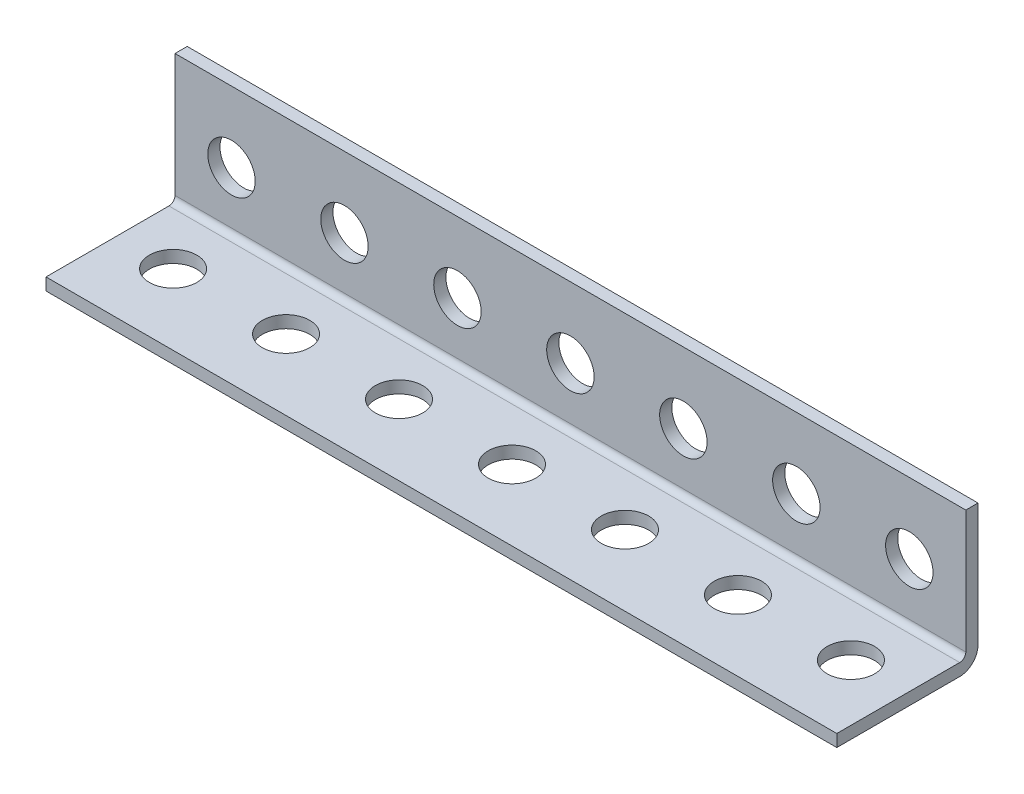
ISO-10303-21;
HEADER;
FILE_DESCRIPTION(('STEP AP214'),'2;1');
FILE_NAME('part.step','',(''),(''),'','','');
FILE_SCHEMA(('AUTOMOTIVE_DESIGN { 1 0 10303 214 1 1 1 1 }'));
ENDSEC;
DATA;
#1=APPLICATION_CONTEXT('core data for automotive mechanical design processes');
#2=APPLICATION_PROTOCOL_DEFINITION('international standard','automotive_design',2000,#1);
#3=PRODUCT_CONTEXT('',#1,'mechanical');
#4=PRODUCT('Part','Part','',(#3));
#5=PRODUCT_RELATED_PRODUCT_CATEGORY('part','',(#4));
#6=PRODUCT_DEFINITION_FORMATION('','',#4);
#7=PRODUCT_DEFINITION_CONTEXT('part definition',#1,'design');
#8=PRODUCT_DEFINITION('design','',#6,#7);
#9=PRODUCT_DEFINITION_SHAPE('','',#8);
#10=(LENGTH_UNIT() NAMED_UNIT(*) SI_UNIT(.MILLI.,.METRE.));
#11=(NAMED_UNIT(*) PLANE_ANGLE_UNIT() SI_UNIT($,.RADIAN.));
#12=(NAMED_UNIT(*) SI_UNIT($,.STERADIAN.) SOLID_ANGLE_UNIT());
#13=UNCERTAINTY_MEASURE_WITH_UNIT(LENGTH_MEASURE(1.E-05),#10,'distance_accuracy_value','');
#14=(GEOMETRIC_REPRESENTATION_CONTEXT(3) GLOBAL_UNCERTAINTY_ASSIGNED_CONTEXT((#13)) GLOBAL_UNIT_ASSIGNED_CONTEXT((#10,
#11,#12)) REPRESENTATION_CONTEXT('',''));
#15=CARTESIAN_POINT('',(0.,0.,0.));
#16=DIRECTION('',(0.,0.,1.));
#17=DIRECTION('',(1.,0.,0.));
#18=AXIS2_PLACEMENT_3D('',#15,#16,#17);
#19=CARTESIAN_POINT('',(609.6,-15.875,15.875));
#20=DIRECTION('',(0.,0.,-1.));
#21=DIRECTION('',(-1.,0.,0.));
#22=AXIS2_PLACEMENT_3D('',#19,#20,#21);
#23=PLANE('',#22);
#24=DIRECTION('',(0.,-1.,0.));
#25=VECTOR('',#24,1.);
#26=CARTESIAN_POINT('',(-431.8,-15.875,15.875));
#27=LINE('',#26,#25);
#28=CARTESIAN_POINT('',(-431.8,-13.1318,15.875));
#29=VERTEX_POINT('',#28);
#30=CARTESIAN_POINT('',(-431.8,-15.875,15.875));
#31=VERTEX_POINT('',#30);
#32=EDGE_CURVE('E250',#29,#31,#27,.T.);
#33=ORIENTED_EDGE('',*,*,#32,.F.);
#34=DIRECTION('',(-1.,0.,0.));
#35=VECTOR('',#34,1.);
#36=CARTESIAN_POINT('',(609.6,-13.1318,15.875));
#37=LINE('',#36,#35);
#38=CARTESIAN_POINT('',(-609.6,-13.1318,15.875));
#39=VERTEX_POINT('',#38);
#40=EDGE_CURVE('E71',#29,#39,#37,.T.);
#41=ORIENTED_EDGE('',*,*,#40,.T.);
#42=DIRECTION('',(0.,-1.,0.));
#43=VECTOR('',#42,1.);
#44=CARTESIAN_POINT('',(-609.6,-15.875,15.875));
#45=LINE('',#44,#43);
#46=CARTESIAN_POINT('',(-609.6,-15.875,15.875));
#47=VERTEX_POINT('',#46);
#48=EDGE_CURVE('E209',#39,#47,#45,.T.);
#49=ORIENTED_EDGE('',*,*,#48,.T.);
#50=DIRECTION('',(-1.,0.,0.));
#51=VECTOR('',#50,1.);
#52=CARTESIAN_POINT('',(609.6,-15.875,15.875));
#53=LINE('',#52,#51);
#54=EDGE_CURVE('E146',#31,#47,#53,.T.);
#55=ORIENTED_EDGE('',*,*,#54,.F.);
#56=EDGE_LOOP('',(#33,#41,#49,#55));
#57=FACE_BOUND('',#56,.T.);
#58=ADVANCED_FACE('F49',(#57),#23,.F.);
#59=CARTESIAN_POINT('',(609.6,-15.875,-11.7602));
#60=DIRECTION('',(0.,1.,0.));
#61=DIRECTION('',(0.,0.,1.));
#62=AXIS2_PLACEMENT_3D('',#59,#60,#61);
#63=PLANE('',#62);
#64=CARTESIAN_POINT('',(-596.9,-15.875,0.));
#65=DIRECTION('',(0.,1.,0.));
#66=DIRECTION('',(0.,0.,1.));
#67=AXIS2_PLACEMENT_3D('',#64,#65,#66);
#68=CIRCLE('',#67,5.33400000000005);
#69=CARTESIAN_POINT('',(-596.9,-15.875,5.33400000000005));
#70=VERTEX_POINT('',#69);
#71=EDGE_CURVE('E219',#70,#70,#68,.T.);
#72=ORIENTED_EDGE('',*,*,#71,.T.);
#73=EDGE_LOOP('',(#72));
#74=FACE_BOUND('',#73,.T.);
#75=CARTESIAN_POINT('',(-571.5,-15.875,0.));
#76=DIRECTION('',(0.,1.,0.));
#77=DIRECTION('',(0.,0.,1.));
#78=AXIS2_PLACEMENT_3D('',#75,#76,#77);
#79=CIRCLE('',#78,5.33400000000005);
#80=CARTESIAN_POINT('',(-571.5,-15.875,5.33400000000005));
#81=VERTEX_POINT('',#80);
#82=EDGE_CURVE('E269',#81,#81,#79,.T.);
#83=ORIENTED_EDGE('',*,*,#82,.T.);
#84=EDGE_LOOP('',(#83));
#85=FACE_BOUND('',#84,.T.);
#86=CARTESIAN_POINT('',(-546.1,-15.875,0.));
#87=DIRECTION('',(0.,1.,0.));
#88=DIRECTION('',(0.,0.,1.));
#89=AXIS2_PLACEMENT_3D('',#86,#87,#88);
#90=CIRCLE('',#89,5.33400000000005);
#91=CARTESIAN_POINT('',(-546.1,-15.875,5.33400000000005));
#92=VERTEX_POINT('',#91);
#93=EDGE_CURVE('E267',#92,#92,#90,.T.);
#94=ORIENTED_EDGE('',*,*,#93,.T.);
#95=EDGE_LOOP('',(#94));
#96=FACE_BOUND('',#95,.T.);
#97=CARTESIAN_POINT('',(-520.7,-15.875,0.));
#98=DIRECTION('',(0.,1.,0.));
#99=DIRECTION('',(0.,0.,1.));
#100=AXIS2_PLACEMENT_3D('',#97,#98,#99);
#101=CIRCLE('',#100,5.33400000000005);
#102=CARTESIAN_POINT('',(-520.7,-15.875,5.33400000000005));
#103=VERTEX_POINT('',#102);
#104=EDGE_CURVE('E264',#103,#103,#101,.T.);
#105=ORIENTED_EDGE('',*,*,#104,.T.);
#106=EDGE_LOOP('',(#105));
#107=FACE_BOUND('',#106,.T.);
#108=CARTESIAN_POINT('',(-495.3,-15.875,0.));
#109=DIRECTION('',(0.,1.,0.));
#110=DIRECTION('',(0.,0.,1.));
#111=AXIS2_PLACEMENT_3D('',#108,#109,#110);
#112=CIRCLE('',#111,5.33400000000005);
#113=CARTESIAN_POINT('',(-495.3,-15.875,5.33400000000005));
#114=VERTEX_POINT('',#113);
#115=EDGE_CURVE('E261',#114,#114,#112,.T.);
#116=ORIENTED_EDGE('',*,*,#115,.T.);
#117=EDGE_LOOP('',(#116));
#118=FACE_BOUND('',#117,.T.);
#119=CARTESIAN_POINT('',(-469.9,-15.875,0.));
#120=DIRECTION('',(0.,1.,0.));
#121=DIRECTION('',(0.,0.,1.));
#122=AXIS2_PLACEMENT_3D('',#119,#120,#121);
#123=CIRCLE('',#122,5.33400000000005);
#124=CARTESIAN_POINT('',(-469.9,-15.875,5.33400000000005));
#125=VERTEX_POINT('',#124);
#126=EDGE_CURVE('E258',#125,#125,#123,.T.);
#127=ORIENTED_EDGE('',*,*,#126,.T.);
#128=EDGE_LOOP('',(#127));
#129=FACE_BOUND('',#128,.T.);
#130=CARTESIAN_POINT('',(-444.5,-15.875,0.));
#131=DIRECTION('',(0.,1.,0.));
#132=DIRECTION('',(0.,0.,1.));
#133=AXIS2_PLACEMENT_3D('',#130,#131,#132);
#134=CIRCLE('',#133,5.33400000000005);
#135=CARTESIAN_POINT('',(-444.5,-15.875,5.33400000000005));
#136=VERTEX_POINT('',#135);
#137=EDGE_CURVE('E193',#136,#136,#134,.T.);
#138=ORIENTED_EDGE('',*,*,#137,.T.);
#139=EDGE_LOOP('',(#138));
#140=FACE_BOUND('',#139,.T.);
#141=DIRECTION('',(0.,0.,-1.));
#142=VECTOR('',#141,1.);
#143=CARTESIAN_POINT('',(-431.8,-15.875,54.125));
#144=LINE('',#143,#142);
#145=CARTESIAN_POINT('',(-431.8,-15.875,-11.7602));
#146=VERTEX_POINT('',#145);
#147=EDGE_CURVE('E131',#31,#146,#144,.T.);
#148=ORIENTED_EDGE('',*,*,#147,.F.);
#149=ORIENTED_EDGE('',*,*,#54,.T.);
#150=DIRECTION('',(0.,0.,-1.));
#151=VECTOR('',#150,1.);
#152=CARTESIAN_POINT('',(-609.6,-15.875,-11.7602));
#153=LINE('',#152,#151);
#154=CARTESIAN_POINT('',(-609.6,-15.875,-11.7602));
#155=VERTEX_POINT('',#154);
#156=EDGE_CURVE('E212',#47,#155,#153,.T.);
#157=ORIENTED_EDGE('',*,*,#156,.T.);
#158=DIRECTION('',(-1.,0.,0.));
#159=VECTOR('',#158,1.);
#160=CARTESIAN_POINT('',(609.6,-15.875,-11.7602));
#161=LINE('',#160,#159);
#162=EDGE_CURVE('E139',#146,#155,#161,.T.);
#163=ORIENTED_EDGE('',*,*,#162,.F.);
#164=EDGE_LOOP('',(#148,#149,#157,#163));
#165=FACE_BOUND('',#164,.T.);
#166=ADVANCED_FACE('F276',(#74,#85,#96,#107,#118,#129,#140,#165),#63,.F.);
#167=CARTESIAN_POINT('',(609.6,-11.7602,-11.7602));
#168=DIRECTION('',(-1.,0.,0.));
#169=DIRECTION('',(0.,0.,1.));
#170=AXIS2_PLACEMENT_3D('',#167,#168,#169);
#171=CYLINDRICAL_SURFACE('',#170,4.11479999999997);
#172=CARTESIAN_POINT('',(-431.8,-11.7602,-11.7602));
#173=DIRECTION('',(1.,0.,0.));
#174=DIRECTION('',(0.,0.,-1.));
#175=AXIS2_PLACEMENT_3D('',#172,#173,#174);
#176=CIRCLE('',#175,4.11479999999997);
#177=CARTESIAN_POINT('',(-431.8,-11.7602,-15.875));
#178=VERTEX_POINT('',#177);
#179=EDGE_CURVE('E119',#146,#178,#176,.T.);
#180=ORIENTED_EDGE('',*,*,#179,.F.);
#181=ORIENTED_EDGE('',*,*,#162,.T.);
#182=CARTESIAN_POINT('',(-609.6,-11.7602,-11.7602));
#183=DIRECTION('',(1.,0.,0.));
#184=DIRECTION('',(0.,0.,1.));
#185=AXIS2_PLACEMENT_3D('',#182,#183,#184);
#186=CIRCLE('',#185,4.11479999999997);
#187=CARTESIAN_POINT('',(-609.6,-11.7602,-15.875));
#188=VERTEX_POINT('',#187);
#189=EDGE_CURVE('E216',#155,#188,#186,.T.);
#190=ORIENTED_EDGE('',*,*,#189,.T.);
#191=DIRECTION('',(-1.,0.,0.));
#192=VECTOR('',#191,1.);
#193=CARTESIAN_POINT('',(609.6,-11.7602,-15.875));
#194=LINE('',#193,#192);
#195=EDGE_CURVE('E137',#178,#188,#194,.T.);
#196=ORIENTED_EDGE('',*,*,#195,.F.);
#197=EDGE_LOOP('',(#180,#181,#190,#196));
#198=FACE_BOUND('',#197,.T.);
#199=ADVANCED_FACE('F305',(#198),#171,.T.);
#200=CARTESIAN_POINT('',(609.6,15.875,-15.875));
#201=DIRECTION('',(0.,0.,1.));
#202=DIRECTION('',(0.,-1.,0.));
#203=AXIS2_PLACEMENT_3D('',#200,#201,#202);
#204=PLANE('',#203);
#205=CARTESIAN_POINT('',(-596.9,-1.46198334882211E-13,-15.875));
#206=DIRECTION('',(0.,0.,1.));
#207=DIRECTION('',(1.,0.,0.));
#208=AXIS2_PLACEMENT_3D('',#205,#206,#207);
#209=CIRCLE('',#208,5.33400000000005);
#210=CARTESIAN_POINT('',(-591.566,-1.46198334882211E-13,-15.875));
#211=VERTEX_POINT('',#210);
#212=EDGE_CURVE('E184',#211,#211,#209,.T.);
#213=ORIENTED_EDGE('',*,*,#212,.T.);
#214=EDGE_LOOP('',(#213));
#215=FACE_BOUND('',#214,.T.);
#216=CARTESIAN_POINT('',(-571.5,-1.43087732012377E-13,-15.875));
#217=DIRECTION('',(0.,0.,1.));
#218=DIRECTION('',(1.,0.,0.));
#219=AXIS2_PLACEMENT_3D('',#216,#217,#218);
#220=CIRCLE('',#219,5.33400000000005);
#221=CARTESIAN_POINT('',(-566.166,-1.43087732012377E-13,-15.875));
#222=VERTEX_POINT('',#221);
#223=EDGE_CURVE('E178',#222,#222,#220,.T.);
#224=ORIENTED_EDGE('',*,*,#223,.T.);
#225=EDGE_LOOP('',(#224));
#226=FACE_BOUND('',#225,.T.);
#227=CARTESIAN_POINT('',(-546.1,-1.39977129142542E-13,-15.875));
#228=DIRECTION('',(0.,0.,1.));
#229=DIRECTION('',(1.,0.,0.));
#230=AXIS2_PLACEMENT_3D('',#227,#228,#229);
#231=CIRCLE('',#230,5.33400000000005);
#232=CARTESIAN_POINT('',(-540.766,-1.39977129142542E-13,-15.875));
#233=VERTEX_POINT('',#232);
#234=EDGE_CURVE('E172',#233,#233,#231,.T.);
#235=ORIENTED_EDGE('',*,*,#234,.T.);
#236=EDGE_LOOP('',(#235));
#237=FACE_BOUND('',#236,.T.);
#238=CARTESIAN_POINT('',(-520.7,-1.36866526272708E-13,-15.875));
#239=DIRECTION('',(0.,0.,1.));
#240=DIRECTION('',(1.,0.,0.));
#241=AXIS2_PLACEMENT_3D('',#238,#239,#240);
#242=CIRCLE('',#241,5.33400000000005);
#243=CARTESIAN_POINT('',(-515.366,-1.36866526272708E-13,-15.875));
#244=VERTEX_POINT('',#243);
#245=EDGE_CURVE('E166',#244,#244,#242,.T.);
#246=ORIENTED_EDGE('',*,*,#245,.T.);
#247=EDGE_LOOP('',(#246));
#248=FACE_BOUND('',#247,.T.);
#249=CARTESIAN_POINT('',(-495.3,-1.33755923402874E-13,-15.875));
#250=DIRECTION('',(0.,0.,1.));
#251=DIRECTION('',(1.,0.,0.));
#252=AXIS2_PLACEMENT_3D('',#249,#250,#251);
#253=CIRCLE('',#252,5.33400000000005);
#254=CARTESIAN_POINT('',(-489.966,-1.33755923402874E-13,-15.875));
#255=VERTEX_POINT('',#254);
#256=EDGE_CURVE('E160',#255,#255,#253,.T.);
#257=ORIENTED_EDGE('',*,*,#256,.T.);
#258=EDGE_LOOP('',(#257));
#259=FACE_BOUND('',#258,.T.);
#260=CARTESIAN_POINT('',(-469.9,-1.3064532053304E-13,-15.875));
#261=DIRECTION('',(0.,0.,1.));
#262=DIRECTION('',(1.,0.,0.));
#263=AXIS2_PLACEMENT_3D('',#260,#261,#262);
#264=CIRCLE('',#263,5.33400000000005);
#265=CARTESIAN_POINT('',(-464.566,-1.3064532053304E-13,-15.875));
#266=VERTEX_POINT('',#265);
#267=EDGE_CURVE('E154',#266,#266,#264,.T.);
#268=ORIENTED_EDGE('',*,*,#267,.T.);
#269=EDGE_LOOP('',(#268));
#270=FACE_BOUND('',#269,.T.);
#271=CARTESIAN_POINT('',(-444.5,-1.27534717663205E-13,-15.875));
#272=DIRECTION('',(0.,0.,1.));
#273=DIRECTION('',(1.,0.,0.));
#274=AXIS2_PLACEMENT_3D('',#271,#272,#273);
#275=CIRCLE('',#274,5.33400000000005);
#276=CARTESIAN_POINT('',(-439.166,-1.27534717663205E-13,-15.875));
#277=VERTEX_POINT('',#276);
#278=EDGE_CURVE('E148',#277,#277,#275,.T.);
#279=ORIENTED_EDGE('',*,*,#278,.T.);
#280=EDGE_LOOP('',(#279));
#281=FACE_BOUND('',#280,.T.);
#282=DIRECTION('',(0.,-1.,0.));
#283=VECTOR('',#282,1.);
#284=CARTESIAN_POINT('',(-431.8,0.,-15.875));
#285=LINE('',#284,#283);
#286=CARTESIAN_POINT('',(-431.8,15.875,-15.875));
#287=VERTEX_POINT('',#286);
#288=EDGE_CURVE('E113',#287,#178,#285,.T.);
#289=ORIENTED_EDGE('',*,*,#288,.T.);
#290=ORIENTED_EDGE('',*,*,#195,.T.);
#291=DIRECTION('',(0.,1.,0.));
#292=VECTOR('',#291,1.);
#293=CARTESIAN_POINT('',(-609.6,15.875,-15.875));
#294=LINE('',#293,#292);
#295=CARTESIAN_POINT('',(-609.6,15.875,-15.875));
#296=VERTEX_POINT('',#295);
#297=EDGE_CURVE('E136',#188,#296,#294,.T.);
#298=ORIENTED_EDGE('',*,*,#297,.T.);
#299=DIRECTION('',(-1.,0.,0.));
#300=VECTOR('',#299,1.);
#301=CARTESIAN_POINT('',(609.6,15.875,-15.875));
#302=LINE('',#301,#300);
#303=EDGE_CURVE('E128',#287,#296,#302,.T.);
#304=ORIENTED_EDGE('',*,*,#303,.F.);
#305=EDGE_LOOP('',(#289,#290,#298,#304));
#306=FACE_BOUND('',#305,.T.);
#307=ADVANCED_FACE('F134',(#215,#226,#237,#248,#259,#270,#281,#306),#204,.F.);
#308=CARTESIAN_POINT('',(609.6,15.875,-13.1318));
#309=DIRECTION('',(0.,-1.,0.));
#310=DIRECTION('',(0.,0.,-1.));
#311=AXIS2_PLACEMENT_3D('',#308,#309,#310);
#312=PLANE('',#311);
#313=DIRECTION('',(0.,0.,-1.));
#314=VECTOR('',#313,1.);
#315=CARTESIAN_POINT('',(-431.8,15.875,54.125));
#316=LINE('',#315,#314);
#317=CARTESIAN_POINT('',(-431.8,15.875,-13.1318));
#318=VERTEX_POINT('',#317);
#319=EDGE_CURVE('E116',#318,#287,#316,.T.);
#320=ORIENTED_EDGE('',*,*,#319,.T.);
#321=ORIENTED_EDGE('',*,*,#303,.T.);
#322=DIRECTION('',(0.,0.,1.));
#323=VECTOR('',#322,1.);
#324=CARTESIAN_POINT('',(-609.6,15.875,-13.1318));
#325=LINE('',#324,#323);
#326=CARTESIAN_POINT('',(-609.6,15.875,-13.1318));
#327=VERTEX_POINT('',#326);
#328=EDGE_CURVE('E225',#296,#327,#325,.T.);
#329=ORIENTED_EDGE('',*,*,#328,.T.);
#330=DIRECTION('',(-1.,0.,0.));
#331=VECTOR('',#330,1.);
#332=CARTESIAN_POINT('',(609.6,15.875,-13.1318));
#333=LINE('',#332,#331);
#334=EDGE_CURVE('E130',#318,#327,#333,.T.);
#335=ORIENTED_EDGE('',*,*,#334,.F.);
#336=EDGE_LOOP('',(#320,#321,#329,#335));
#337=FACE_BOUND('',#336,.T.);
#338=ADVANCED_FACE('F126',(#337),#312,.F.);
#339=CARTESIAN_POINT('',(609.6,-11.7602,-13.1318));
#340=DIRECTION('',(0.,0.,-1.));
#341=DIRECTION('',(0.,1.,0.));
#342=AXIS2_PLACEMENT_3D('',#339,#340,#341);
#343=PLANE('',#342);
#344=CARTESIAN_POINT('',(-596.9,-1.46198334882211E-13,-13.1318));
#345=DIRECTION('',(0.,0.,-1.));
#346=DIRECTION('',(0.,1.,0.));
#347=AXIS2_PLACEMENT_3D('',#344,#345,#346);
#348=CIRCLE('',#347,5.33400000000005);
#349=CARTESIAN_POINT('',(-596.9,5.3339999999999,-13.1318));
#350=VERTEX_POINT('',#349);
#351=EDGE_CURVE('E57',#350,#350,#348,.T.);
#352=ORIENTED_EDGE('',*,*,#351,.T.);
#353=EDGE_LOOP('',(#352));
#354=FACE_BOUND('',#353,.T.);
#355=CARTESIAN_POINT('',(-571.5,-1.43087732012377E-13,-13.1318));
#356=DIRECTION('',(0.,0.,-1.));
#357=DIRECTION('',(0.,1.,0.));
#358=AXIS2_PLACEMENT_3D('',#355,#356,#357);
#359=CIRCLE('',#358,5.33400000000005);
#360=CARTESIAN_POINT('',(-571.5,5.33399999999991,-13.1318));
#361=VERTEX_POINT('',#360);
#362=EDGE_CURVE('E181',#361,#361,#359,.T.);
#363=ORIENTED_EDGE('',*,*,#362,.T.);
#364=EDGE_LOOP('',(#363));
#365=FACE_BOUND('',#364,.T.);
#366=CARTESIAN_POINT('',(-546.1,-1.39977129142542E-13,-13.1318));
#367=DIRECTION('',(0.,0.,-1.));
#368=DIRECTION('',(0.,1.,0.));
#369=AXIS2_PLACEMENT_3D('',#366,#367,#368);
#370=CIRCLE('',#369,5.33400000000005);
#371=CARTESIAN_POINT('',(-546.1,5.33399999999991,-13.1318));
#372=VERTEX_POINT('',#371);
#373=EDGE_CURVE('E175',#372,#372,#370,.T.);
#374=ORIENTED_EDGE('',*,*,#373,.T.);
#375=EDGE_LOOP('',(#374));
#376=FACE_BOUND('',#375,.T.);
#377=CARTESIAN_POINT('',(-520.7,-1.36866526272708E-13,-13.1318));
#378=DIRECTION('',(0.,0.,-1.));
#379=DIRECTION('',(0.,1.,0.));
#380=AXIS2_PLACEMENT_3D('',#377,#378,#379);
#381=CIRCLE('',#380,5.33400000000005);
#382=CARTESIAN_POINT('',(-520.7,5.33399999999991,-13.1318));
#383=VERTEX_POINT('',#382);
#384=EDGE_CURVE('E169',#383,#383,#381,.T.);
#385=ORIENTED_EDGE('',*,*,#384,.T.);
#386=EDGE_LOOP('',(#385));
#387=FACE_BOUND('',#386,.T.);
#388=CARTESIAN_POINT('',(-495.3,-1.33755923402874E-13,-13.1318));
#389=DIRECTION('',(0.,0.,-1.));
#390=DIRECTION('',(0.,1.,0.));
#391=AXIS2_PLACEMENT_3D('',#388,#389,#390);
#392=CIRCLE('',#391,5.33400000000005);
#393=CARTESIAN_POINT('',(-495.3,5.33399999999992,-13.1318));
#394=VERTEX_POINT('',#393);
#395=EDGE_CURVE('E163',#394,#394,#392,.T.);
#396=ORIENTED_EDGE('',*,*,#395,.T.);
#397=EDGE_LOOP('',(#396));
#398=FACE_BOUND('',#397,.T.);
#399=CARTESIAN_POINT('',(-469.9,-1.3064532053304E-13,-13.1318));
#400=DIRECTION('',(0.,0.,-1.));
#401=DIRECTION('',(0.,1.,0.));
#402=AXIS2_PLACEMENT_3D('',#399,#400,#401);
#403=CIRCLE('',#402,5.33400000000005);
#404=CARTESIAN_POINT('',(-469.9,5.33399999999992,-13.1318));
#405=VERTEX_POINT('',#404);
#406=EDGE_CURVE('E157',#405,#405,#403,.T.);
#407=ORIENTED_EDGE('',*,*,#406,.T.);
#408=EDGE_LOOP('',(#407));
#409=FACE_BOUND('',#408,.T.);
#410=CARTESIAN_POINT('',(-444.5,-1.27534717663205E-13,-13.1318));
#411=DIRECTION('',(0.,0.,-1.));
#412=DIRECTION('',(0.,1.,0.));
#413=AXIS2_PLACEMENT_3D('',#410,#411,#412);
#414=CIRCLE('',#413,5.33400000000005);
#415=CARTESIAN_POINT('',(-444.5,5.33399999999992,-13.1318));
#416=VERTEX_POINT('',#415);
#417=EDGE_CURVE('E151',#416,#416,#414,.T.);
#418=ORIENTED_EDGE('',*,*,#417,.T.);
#419=EDGE_LOOP('',(#418));
#420=FACE_BOUND('',#419,.T.);
#421=DIRECTION('',(0.,-1.,0.));
#422=VECTOR('',#421,1.);
#423=CARTESIAN_POINT('',(-431.8,-11.7602,-13.1318));
#424=LINE('',#423,#422);
#425=CARTESIAN_POINT('',(-431.8,-11.7602,-13.1318));
#426=VERTEX_POINT('',#425);
#427=EDGE_CURVE('E249',#318,#426,#424,.T.);
#428=ORIENTED_EDGE('',*,*,#427,.F.);
#429=ORIENTED_EDGE('',*,*,#334,.T.);
#430=DIRECTION('',(0.,-1.,0.));
#431=VECTOR('',#430,1.);
#432=CARTESIAN_POINT('',(-609.6,-11.7602,-13.1318));
#433=LINE('',#432,#431);
#434=CARTESIAN_POINT('',(-609.6,-11.7602,-13.1318));
#435=VERTEX_POINT('',#434);
#436=EDGE_CURVE('E227',#327,#435,#433,.T.);
#437=ORIENTED_EDGE('',*,*,#436,.T.);
#438=DIRECTION('',(-1.,0.,0.));
#439=VECTOR('',#438,1.);
#440=CARTESIAN_POINT('',(609.6,-11.7602,-13.1318));
#441=LINE('',#440,#439);
#442=EDGE_CURVE('E141',#426,#435,#441,.T.);
#443=ORIENTED_EDGE('',*,*,#442,.F.);
#444=EDGE_LOOP('',(#428,#429,#437,#443));
#445=FACE_BOUND('',#444,.T.);
#446=ADVANCED_FACE('F248',(#354,#365,#376,#387,#398,#409,#420,#445),#343,.F.);
#447=CARTESIAN_POINT('',(609.6,-11.7602,-11.7602));
#448=DIRECTION('',(-1.,0.,0.));
#449=DIRECTION('',(0.,0.,1.));
#450=AXIS2_PLACEMENT_3D('',#447,#448,#449);
#451=CYLINDRICAL_SURFACE('',#450,1.37159999999999);
#452=CARTESIAN_POINT('',(-431.8,-11.7602,-11.7602));
#453=DIRECTION('',(1.,0.,0.));
#454=DIRECTION('',(0.,0.,-1.));
#455=AXIS2_PLACEMENT_3D('',#452,#453,#454);
#456=CIRCLE('',#455,1.37159999999999);
#457=CARTESIAN_POINT('',(-431.8,-13.1318,-11.7602));
#458=VERTEX_POINT('',#457);
#459=EDGE_CURVE('E63',#426,#458,#456,.F.);
#460=ORIENTED_EDGE('',*,*,#459,.F.);
#461=ORIENTED_EDGE('',*,*,#442,.T.);
#462=CARTESIAN_POINT('',(-609.6,-11.7602,-11.7602));
#463=DIRECTION('',(-1.,0.,0.));
#464=DIRECTION('',(0.,0.,-1.));
#465=AXIS2_PLACEMENT_3D('',#462,#463,#464);
#466=CIRCLE('',#465,1.37159999999999);
#467=CARTESIAN_POINT('',(-609.6,-13.1318,-11.7602));
#468=VERTEX_POINT('',#467);
#469=EDGE_CURVE('E230',#435,#468,#466,.T.);
#470=ORIENTED_EDGE('',*,*,#469,.T.);
#471=DIRECTION('',(-1.,0.,0.));
#472=VECTOR('',#471,1.);
#473=CARTESIAN_POINT('',(609.6,-13.1318,-11.7602));
#474=LINE('',#473,#472);
#475=EDGE_CURVE('E237',#458,#468,#474,.T.);
#476=ORIENTED_EDGE('',*,*,#475,.F.);
#477=EDGE_LOOP('',(#460,#461,#470,#476));
#478=FACE_BOUND('',#477,.T.);
#479=ADVANCED_FACE('F241',(#478),#451,.F.);
#480=CARTESIAN_POINT('',(609.6,-13.1318,15.875));
#481=DIRECTION('',(0.,-1.,0.));
#482=DIRECTION('',(0.,0.,-1.));
#483=AXIS2_PLACEMENT_3D('',#480,#481,#482);
#484=PLANE('',#483);
#485=CARTESIAN_POINT('',(-596.9,-13.1318,0.));
#486=DIRECTION('',(0.,-1.,0.));
#487=DIRECTION('',(0.,0.,-1.));
#488=AXIS2_PLACEMENT_3D('',#485,#486,#487);
#489=CIRCLE('',#488,5.33400000000005);
#490=CARTESIAN_POINT('',(-596.9,-13.1318,-5.33400000000005));
#491=VERTEX_POINT('',#490);
#492=EDGE_CURVE('E189',#491,#491,#489,.T.);
#493=ORIENTED_EDGE('',*,*,#492,.T.);
#494=EDGE_LOOP('',(#493));
#495=FACE_BOUND('',#494,.T.);
#496=CARTESIAN_POINT('',(-571.5,-13.1318,0.));
#497=DIRECTION('',(0.,-1.,0.));
#498=DIRECTION('',(0.,0.,-1.));
#499=AXIS2_PLACEMENT_3D('',#496,#497,#498);
#500=CIRCLE('',#499,5.33400000000005);
#501=CARTESIAN_POINT('',(-571.5,-13.1318,-5.33400000000005));
#502=VERTEX_POINT('',#501);
#503=EDGE_CURVE('E192',#502,#502,#500,.T.);
#504=ORIENTED_EDGE('',*,*,#503,.T.);
#505=EDGE_LOOP('',(#504));
#506=FACE_BOUND('',#505,.T.);
#507=CARTESIAN_POINT('',(-546.1,-13.1318,0.));
#508=DIRECTION('',(0.,-1.,0.));
#509=DIRECTION('',(0.,0.,-1.));
#510=AXIS2_PLACEMENT_3D('',#507,#508,#509);
#511=CIRCLE('',#510,5.33400000000005);
#512=CARTESIAN_POINT('',(-546.1,-13.1318,-5.33400000000005));
#513=VERTEX_POINT('',#512);
#514=EDGE_CURVE('E196',#513,#513,#511,.T.);
#515=ORIENTED_EDGE('',*,*,#514,.T.);
#516=EDGE_LOOP('',(#515));
#517=FACE_BOUND('',#516,.T.);
#518=CARTESIAN_POINT('',(-520.7,-13.1318,0.));
#519=DIRECTION('',(0.,-1.,0.));
#520=DIRECTION('',(0.,0.,-1.));
#521=AXIS2_PLACEMENT_3D('',#518,#519,#520);
#522=CIRCLE('',#521,5.33400000000005);
#523=CARTESIAN_POINT('',(-520.7,-13.1318,-5.33400000000005));
#524=VERTEX_POINT('',#523);
#525=EDGE_CURVE('E199',#524,#524,#522,.T.);
#526=ORIENTED_EDGE('',*,*,#525,.T.);
#527=EDGE_LOOP('',(#526));
#528=FACE_BOUND('',#527,.T.);
#529=CARTESIAN_POINT('',(-495.3,-13.1318,0.));
#530=DIRECTION('',(0.,-1.,0.));
#531=DIRECTION('',(0.,0.,-1.));
#532=AXIS2_PLACEMENT_3D('',#529,#530,#531);
#533=CIRCLE('',#532,5.33400000000005);
#534=CARTESIAN_POINT('',(-495.3,-13.1318,-5.33400000000005));
#535=VERTEX_POINT('',#534);
#536=EDGE_CURVE('E202',#535,#535,#533,.T.);
#537=ORIENTED_EDGE('',*,*,#536,.T.);
#538=EDGE_LOOP('',(#537));
#539=FACE_BOUND('',#538,.T.);
#540=CARTESIAN_POINT('',(-469.9,-13.1318,0.));
#541=DIRECTION('',(0.,-1.,0.));
#542=DIRECTION('',(0.,0.,-1.));
#543=AXIS2_PLACEMENT_3D('',#540,#541,#542);
#544=CIRCLE('',#543,5.33400000000005);
#545=CARTESIAN_POINT('',(-469.9,-13.1318,-5.33400000000005));
#546=VERTEX_POINT('',#545);
#547=EDGE_CURVE('E205',#546,#546,#544,.T.);
#548=ORIENTED_EDGE('',*,*,#547,.T.);
#549=EDGE_LOOP('',(#548));
#550=FACE_BOUND('',#549,.T.);
#551=CARTESIAN_POINT('',(-444.5,-13.1318,0.));
#552=DIRECTION('',(0.,-1.,0.));
#553=DIRECTION('',(0.,0.,-1.));
#554=AXIS2_PLACEMENT_3D('',#551,#552,#553);
#555=CIRCLE('',#554,5.33400000000005);
#556=CARTESIAN_POINT('',(-444.5,-13.1318,-5.33400000000005));
#557=VERTEX_POINT('',#556);
#558=EDGE_CURVE('E207',#557,#557,#555,.T.);
#559=ORIENTED_EDGE('',*,*,#558,.T.);
#560=EDGE_LOOP('',(#559));
#561=FACE_BOUND('',#560,.T.);
#562=DIRECTION('',(0.,0.,1.));
#563=VECTOR('',#562,1.);
#564=CARTESIAN_POINT('',(-431.8,-13.1318,15.875));
#565=LINE('',#564,#563);
#566=EDGE_CURVE('E11',#458,#29,#565,.T.);
#567=ORIENTED_EDGE('',*,*,#566,.F.);
#568=ORIENTED_EDGE('',*,*,#475,.T.);
#569=DIRECTION('',(0.,0.,1.));
#570=VECTOR('',#569,1.);
#571=CARTESIAN_POINT('',(-609.6,-13.1318,15.875));
#572=LINE('',#571,#570);
#573=EDGE_CURVE('E233',#468,#39,#572,.T.);
#574=ORIENTED_EDGE('',*,*,#573,.T.);
#575=ORIENTED_EDGE('',*,*,#40,.F.);
#576=EDGE_LOOP('',(#567,#568,#574,#575));
#577=FACE_BOUND('',#576,.T.);
#578=ADVANCED_FACE('F285',(#495,#506,#517,#528,#539,#550,#561,#577),#484,.F.);
#579=CARTESIAN_POINT('',(-596.9,-1.46198334882211E-13,-15.875));
#580=DIRECTION('',(0.,0.,1.));
#581=DIRECTION('',(1.,0.,0.));
#582=AXIS2_PLACEMENT_3D('',#579,#580,#581);
#583=CYLINDRICAL_SURFACE('',#582,5.33400000000005);
#584=ORIENTED_EDGE('',*,*,#212,.F.);
#585=EDGE_LOOP('',(#584));
#586=FACE_BOUND('',#585,.T.);
#587=ORIENTED_EDGE('',*,*,#351,.F.);
#588=EDGE_LOOP('',(#587));
#589=FACE_BOUND('',#588,.T.);
#590=ADVANCED_FACE('F51',(#586,#589),#583,.F.);
#591=CARTESIAN_POINT('',(-571.5,-1.43087732012377E-13,-15.875));
#592=DIRECTION('',(0.,0.,1.));
#593=DIRECTION('',(1.,0.,0.));
#594=AXIS2_PLACEMENT_3D('',#591,#592,#593);
#595=CYLINDRICAL_SURFACE('',#594,5.33400000000005);
#596=ORIENTED_EDGE('',*,*,#223,.F.);
#597=EDGE_LOOP('',(#596));
#598=FACE_BOUND('',#597,.T.);
#599=ORIENTED_EDGE('',*,*,#362,.F.);
#600=EDGE_LOOP('',(#599));
#601=FACE_BOUND('',#600,.T.);
#602=ADVANCED_FACE('F339',(#598,#601),#595,.F.);
#603=CARTESIAN_POINT('',(-546.1,-1.39977129142542E-13,-15.875));
#604=DIRECTION('',(0.,0.,1.));
#605=DIRECTION('',(1.,0.,0.));
#606=AXIS2_PLACEMENT_3D('',#603,#604,#605);
#607=CYLINDRICAL_SURFACE('',#606,5.33400000000005);
#608=ORIENTED_EDGE('',*,*,#234,.F.);
#609=EDGE_LOOP('',(#608));
#610=FACE_BOUND('',#609,.T.);
#611=ORIENTED_EDGE('',*,*,#373,.F.);
#612=EDGE_LOOP('',(#611));
#613=FACE_BOUND('',#612,.T.);
#614=ADVANCED_FACE('F336',(#610,#613),#607,.F.);
#615=CARTESIAN_POINT('',(-520.7,-1.36866526272708E-13,-15.875));
#616=DIRECTION('',(0.,0.,1.));
#617=DIRECTION('',(1.,0.,0.));
#618=AXIS2_PLACEMENT_3D('',#615,#616,#617);
#619=CYLINDRICAL_SURFACE('',#618,5.33400000000005);
#620=ORIENTED_EDGE('',*,*,#245,.F.);
#621=EDGE_LOOP('',(#620));
#622=FACE_BOUND('',#621,.T.);
#623=ORIENTED_EDGE('',*,*,#384,.F.);
#624=EDGE_LOOP('',(#623));
#625=FACE_BOUND('',#624,.T.);
#626=ADVANCED_FACE('F332',(#622,#625),#619,.F.);
#627=CARTESIAN_POINT('',(-495.3,-1.33755923402874E-13,-15.875));
#628=DIRECTION('',(0.,0.,1.));
#629=DIRECTION('',(1.,0.,0.));
#630=AXIS2_PLACEMENT_3D('',#627,#628,#629);
#631=CYLINDRICAL_SURFACE('',#630,5.33400000000005);
#632=ORIENTED_EDGE('',*,*,#256,.F.);
#633=EDGE_LOOP('',(#632));
#634=FACE_BOUND('',#633,.T.);
#635=ORIENTED_EDGE('',*,*,#395,.F.);
#636=EDGE_LOOP('',(#635));
#637=FACE_BOUND('',#636,.T.);
#638=ADVANCED_FACE('F328',(#634,#637),#631,.F.);
#639=CARTESIAN_POINT('',(-469.9,-1.3064532053304E-13,-15.875));
#640=DIRECTION('',(0.,0.,1.));
#641=DIRECTION('',(1.,0.,0.));
#642=AXIS2_PLACEMENT_3D('',#639,#640,#641);
#643=CYLINDRICAL_SURFACE('',#642,5.33400000000005);
#644=ORIENTED_EDGE('',*,*,#267,.F.);
#645=EDGE_LOOP('',(#644));
#646=FACE_BOUND('',#645,.T.);
#647=ORIENTED_EDGE('',*,*,#406,.F.);
#648=EDGE_LOOP('',(#647));
#649=FACE_BOUND('',#648,.T.);
#650=ADVANCED_FACE('F324',(#646,#649),#643,.F.);
#651=CARTESIAN_POINT('',(-444.5,-1.27534717663205E-13,-15.875));
#652=DIRECTION('',(0.,0.,1.));
#653=DIRECTION('',(1.,0.,0.));
#654=AXIS2_PLACEMENT_3D('',#651,#652,#653);
#655=CYLINDRICAL_SURFACE('',#654,5.33400000000005);
#656=ORIENTED_EDGE('',*,*,#278,.F.);
#657=EDGE_LOOP('',(#656));
#658=FACE_BOUND('',#657,.T.);
#659=ORIENTED_EDGE('',*,*,#417,.F.);
#660=EDGE_LOOP('',(#659));
#661=FACE_BOUND('',#660,.T.);
#662=ADVANCED_FACE('F321',(#658,#661),#655,.F.);
#663=CARTESIAN_POINT('',(-609.6,-11.7602,-11.7602));
#664=DIRECTION('',(1.,0.,0.));
#665=DIRECTION('',(0.,0.,-1.));
#666=AXIS2_PLACEMENT_3D('',#663,#664,#665);
#667=PLANE('',#666);
#668=ORIENTED_EDGE('',*,*,#48,.F.);
#669=ORIENTED_EDGE('',*,*,#573,.F.);
#670=ORIENTED_EDGE('',*,*,#469,.F.);
#671=ORIENTED_EDGE('',*,*,#436,.F.);
#672=ORIENTED_EDGE('',*,*,#328,.F.);
#673=ORIENTED_EDGE('',*,*,#297,.F.);
#674=ORIENTED_EDGE('',*,*,#189,.F.);
#675=ORIENTED_EDGE('',*,*,#156,.F.);
#676=EDGE_LOOP('',(#668,#669,#670,#671,#672,#673,#674,#675));
#677=FACE_BOUND('',#676,.T.);
#678=ADVANCED_FACE('F247',(#677),#667,.F.);
#679=CARTESIAN_POINT('',(-596.9,-15.875,0.));
#680=DIRECTION('',(0.,1.,0.));
#681=DIRECTION('',(0.,0.,1.));
#682=AXIS2_PLACEMENT_3D('',#679,#680,#681);
#683=CYLINDRICAL_SURFACE('',#682,5.33400000000005);
#684=ORIENTED_EDGE('',*,*,#71,.F.);
#685=EDGE_LOOP('',(#684));
#686=FACE_BOUND('',#685,.T.);
#687=ORIENTED_EDGE('',*,*,#492,.F.);
#688=EDGE_LOOP('',(#687));
#689=FACE_BOUND('',#688,.T.);
#690=ADVANCED_FACE('F278',(#686,#689),#683,.F.);
#691=CARTESIAN_POINT('',(-571.5,-15.875,0.));
#692=DIRECTION('',(0.,1.,0.));
#693=DIRECTION('',(0.,0.,1.));
#694=AXIS2_PLACEMENT_3D('',#691,#692,#693);
#695=CYLINDRICAL_SURFACE('',#694,5.33400000000005);
#696=ORIENTED_EDGE('',*,*,#82,.F.);
#697=EDGE_LOOP('',(#696));
#698=FACE_BOUND('',#697,.T.);
#699=ORIENTED_EDGE('',*,*,#503,.F.);
#700=EDGE_LOOP('',(#699));
#701=FACE_BOUND('',#700,.T.);
#702=ADVANCED_FACE('F281',(#698,#701),#695,.F.);
#703=CARTESIAN_POINT('',(-546.1,-15.875,0.));
#704=DIRECTION('',(0.,1.,0.));
#705=DIRECTION('',(0.,0.,1.));
#706=AXIS2_PLACEMENT_3D('',#703,#704,#705);
#707=CYLINDRICAL_SURFACE('',#706,5.33400000000005);
#708=ORIENTED_EDGE('',*,*,#93,.F.);
#709=EDGE_LOOP('',(#708));
#710=FACE_BOUND('',#709,.T.);
#711=ORIENTED_EDGE('',*,*,#514,.F.);
#712=EDGE_LOOP('',(#711));
#713=FACE_BOUND('',#712,.T.);
#714=ADVANCED_FACE('F380',(#710,#713),#707,.F.);
#715=CARTESIAN_POINT('',(-520.7,-15.875,0.));
#716=DIRECTION('',(0.,1.,0.));
#717=DIRECTION('',(0.,0.,1.));
#718=AXIS2_PLACEMENT_3D('',#715,#716,#717);
#719=CYLINDRICAL_SURFACE('',#718,5.33400000000005);
#720=ORIENTED_EDGE('',*,*,#104,.F.);
#721=EDGE_LOOP('',(#720));
#722=FACE_BOUND('',#721,.T.);
#723=ORIENTED_EDGE('',*,*,#525,.F.);
#724=EDGE_LOOP('',(#723));
#725=FACE_BOUND('',#724,.T.);
#726=ADVANCED_FACE('F384',(#722,#725),#719,.F.);
#727=CARTESIAN_POINT('',(-495.3,-15.875,0.));
#728=DIRECTION('',(0.,1.,0.));
#729=DIRECTION('',(0.,0.,1.));
#730=AXIS2_PLACEMENT_3D('',#727,#728,#729);
#731=CYLINDRICAL_SURFACE('',#730,5.33400000000005);
#732=ORIENTED_EDGE('',*,*,#115,.F.);
#733=EDGE_LOOP('',(#732));
#734=FACE_BOUND('',#733,.T.);
#735=ORIENTED_EDGE('',*,*,#536,.F.);
#736=EDGE_LOOP('',(#735));
#737=FACE_BOUND('',#736,.T.);
#738=ADVANCED_FACE('F388',(#734,#737),#731,.F.);
#739=CARTESIAN_POINT('',(-469.9,-15.875,0.));
#740=DIRECTION('',(0.,1.,0.));
#741=DIRECTION('',(0.,0.,1.));
#742=AXIS2_PLACEMENT_3D('',#739,#740,#741);
#743=CYLINDRICAL_SURFACE('',#742,5.33400000000005);
#744=ORIENTED_EDGE('',*,*,#126,.F.);
#745=EDGE_LOOP('',(#744));
#746=FACE_BOUND('',#745,.T.);
#747=ORIENTED_EDGE('',*,*,#547,.F.);
#748=EDGE_LOOP('',(#747));
#749=FACE_BOUND('',#748,.T.);
#750=ADVANCED_FACE('F392',(#746,#749),#743,.F.);
#751=CARTESIAN_POINT('',(-444.5,-15.875,0.));
#752=DIRECTION('',(0.,1.,0.));
#753=DIRECTION('',(0.,0.,1.));
#754=AXIS2_PLACEMENT_3D('',#751,#752,#753);
#755=CYLINDRICAL_SURFACE('',#754,5.33400000000005);
#756=ORIENTED_EDGE('',*,*,#137,.F.);
#757=EDGE_LOOP('',(#756));
#758=FACE_BOUND('',#757,.T.);
#759=ORIENTED_EDGE('',*,*,#558,.F.);
#760=EDGE_LOOP('',(#759));
#761=FACE_BOUND('',#760,.T.);
#762=ADVANCED_FACE('F396',(#758,#761),#755,.F.);
#763=CARTESIAN_POINT('',(-431.8,0.,54.125));
#764=DIRECTION('',(1.,0.,0.));
#765=DIRECTION('',(0.,0.,-1.));
#766=AXIS2_PLACEMENT_3D('',#763,#764,#765);
#767=PLANE('',#766);
#768=ORIENTED_EDGE('',*,*,#179,.T.);
#769=ORIENTED_EDGE('',*,*,#288,.F.);
#770=ORIENTED_EDGE('',*,*,#319,.F.);
#771=ORIENTED_EDGE('',*,*,#427,.T.);
#772=ORIENTED_EDGE('',*,*,#459,.T.);
#773=ORIENTED_EDGE('',*,*,#566,.T.);
#774=ORIENTED_EDGE('',*,*,#32,.T.);
#775=ORIENTED_EDGE('',*,*,#147,.T.);
#776=EDGE_LOOP('',(#768,#769,#770,#771,#772,#773,#774,#775));
#777=FACE_BOUND('',#776,.T.);
#778=ADVANCED_FACE('F115',(#777),#767,.T.);
#779=CLOSED_SHELL('',(#58,#166,#199,#307,#338,#446,#479,#578,#590,#602,#614,#626,#638,#650,#662,
#678,#690,#702,#714,#726,#738,#750,#762,#778));
#780=MANIFOLD_SOLID_BREP('B2',#779);
#781=ADVANCED_BREP_SHAPE_REPRESENTATION('',(#18,#780),#14);
#782=SHAPE_DEFINITION_REPRESENTATION(#9,#781);
ENDSEC;
END-ISO-10303-21;
